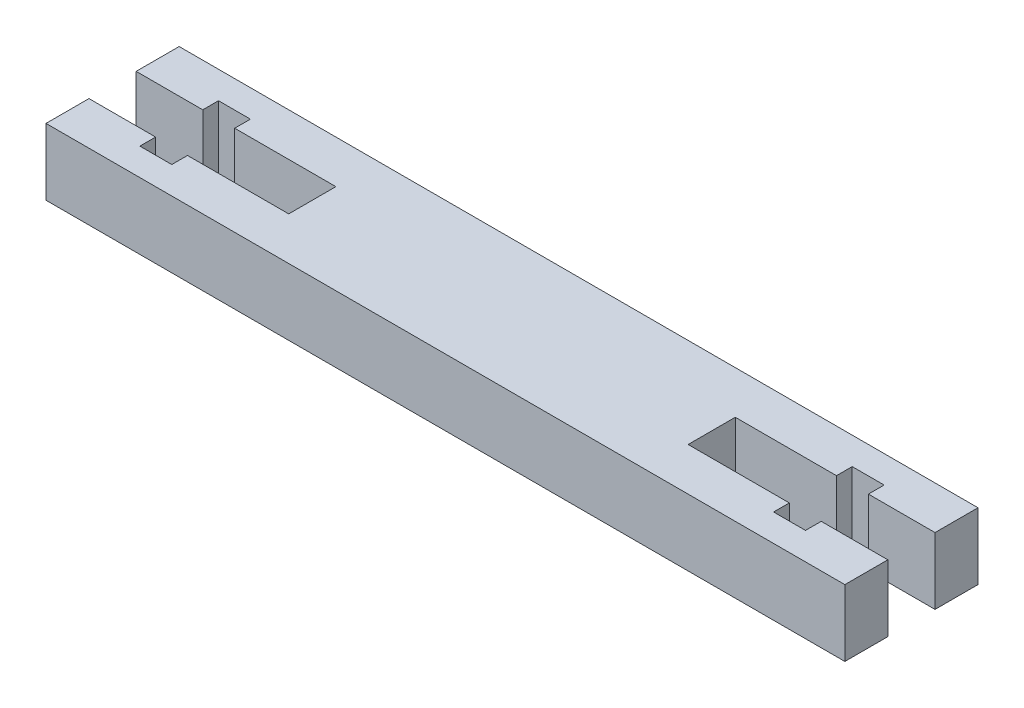
ISO-10303-21;
HEADER;
FILE_DESCRIPTION(('STEP AP214'),'2;1');
FILE_NAME('part.step','',(''),(''),'','','');
FILE_SCHEMA(('AUTOMOTIVE_DESIGN { 1 0 10303 214 1 1 1 1 }'));
ENDSEC;
DATA;
#1=APPLICATION_CONTEXT('core data for automotive mechanical design processes');
#2=APPLICATION_PROTOCOL_DEFINITION('international standard','automotive_design',2000,#1);
#3=PRODUCT_CONTEXT('',#1,'mechanical');
#4=PRODUCT('Part','Part','',(#3));
#5=PRODUCT_RELATED_PRODUCT_CATEGORY('part','',(#4));
#6=PRODUCT_DEFINITION_FORMATION('','',#4);
#7=PRODUCT_DEFINITION_CONTEXT('part definition',#1,'design');
#8=PRODUCT_DEFINITION('design','',#6,#7);
#9=PRODUCT_DEFINITION_SHAPE('','',#8);
#10=(LENGTH_UNIT() NAMED_UNIT(*) SI_UNIT(.MILLI.,.METRE.));
#11=(NAMED_UNIT(*) PLANE_ANGLE_UNIT() SI_UNIT($,.RADIAN.));
#12=(NAMED_UNIT(*) SI_UNIT($,.STERADIAN.) SOLID_ANGLE_UNIT());
#13=UNCERTAINTY_MEASURE_WITH_UNIT(LENGTH_MEASURE(1.E-05),#10,'distance_accuracy_value','');
#14=(GEOMETRIC_REPRESENTATION_CONTEXT(3) GLOBAL_UNCERTAINTY_ASSIGNED_CONTEXT((#13)) GLOBAL_UNIT_ASSIGNED_CONTEXT((#10,
#11,#12)) REPRESENTATION_CONTEXT('',''));
#15=CARTESIAN_POINT('',(0.,0.,0.));
#16=DIRECTION('',(0.,0.,1.));
#17=DIRECTION('',(1.,0.,0.));
#18=AXIS2_PLACEMENT_3D('',#15,#16,#17);
#19=CARTESIAN_POINT('',(0.,6.35,0.));
#20=DIRECTION('',(1.,0.,0.));
#21=DIRECTION('',(0.,0.,-1.));
#22=AXIS2_PLACEMENT_3D('',#19,#20,#21);
#23=PLANE('',#22);
#24=DIRECTION('',(0.,0.,1.));
#25=VECTOR('',#24,1.);
#26=CARTESIAN_POINT('',(0.,0.,0.));
#27=LINE('',#26,#25);
#28=CARTESIAN_POINT('',(0.,0.,0.));
#29=VERTEX_POINT('',#28);
#30=CARTESIAN_POINT('',(0.,0.,4.09999999999997));
#31=VERTEX_POINT('',#30);
#32=EDGE_CURVE('E371',#29,#31,#27,.T.);
#33=ORIENTED_EDGE('',*,*,#32,.T.);
#34=DIRECTION('',(0.,-1.,0.));
#35=VECTOR('',#34,1.);
#36=CARTESIAN_POINT('',(0.,6.35,4.09999999999997));
#37=LINE('',#36,#35);
#38=CARTESIAN_POINT('',(0.,6.35,4.09999999999997));
#39=VERTEX_POINT('',#38);
#40=EDGE_CURVE('E240',#39,#31,#37,.T.);
#41=ORIENTED_EDGE('',*,*,#40,.F.);
#42=DIRECTION('',(0.,0.,1.));
#43=VECTOR('',#42,1.);
#44=CARTESIAN_POINT('',(0.,6.35,0.));
#45=LINE('',#44,#43);
#46=CARTESIAN_POINT('',(0.,6.35,0.));
#47=VERTEX_POINT('',#46);
#48=EDGE_CURVE('E360',#47,#39,#45,.T.);
#49=ORIENTED_EDGE('',*,*,#48,.F.);
#50=DIRECTION('',(0.,-1.,0.));
#51=VECTOR('',#50,1.);
#52=CARTESIAN_POINT('',(0.,6.35,0.));
#53=LINE('',#52,#51);
#54=EDGE_CURVE('E370',#47,#29,#53,.T.);
#55=ORIENTED_EDGE('',*,*,#54,.T.);
#56=EDGE_LOOP('',(#33,#41,#49,#55));
#57=FACE_BOUND('',#56,.T.);
#58=ADVANCED_FACE('F33',(#57),#23,.F.);
#59=CARTESIAN_POINT('',(76.2,6.35,0.));
#60=DIRECTION('',(-1.,0.,0.));
#61=DIRECTION('',(0.,0.,1.));
#62=AXIS2_PLACEMENT_3D('',#59,#60,#61);
#63=PLANE('',#62);
#64=DIRECTION('',(0.,0.,-1.));
#65=VECTOR('',#64,1.);
#66=CARTESIAN_POINT('',(76.2,0.,0.));
#67=LINE('',#66,#65);
#68=CARTESIAN_POINT('',(76.2,0.,12.7));
#69=VERTEX_POINT('',#68);
#70=CARTESIAN_POINT('',(76.2,0.,8.60000000000005));
#71=VERTEX_POINT('',#70);
#72=EDGE_CURVE('E377',#69,#71,#67,.T.);
#73=ORIENTED_EDGE('',*,*,#72,.T.);
#74=DIRECTION('',(0.,-1.,0.));
#75=VECTOR('',#74,1.);
#76=CARTESIAN_POINT('',(76.2,6.35,8.60000000000005));
#77=LINE('',#76,#75);
#78=CARTESIAN_POINT('',(76.2,6.35,8.60000000000005));
#79=VERTEX_POINT('',#78);
#80=EDGE_CURVE('E267',#79,#71,#77,.T.);
#81=ORIENTED_EDGE('',*,*,#80,.F.);
#82=DIRECTION('',(0.,0.,-1.));
#83=VECTOR('',#82,1.);
#84=CARTESIAN_POINT('',(76.2,6.35,0.));
#85=LINE('',#84,#83);
#86=CARTESIAN_POINT('',(76.2,6.35,12.7));
#87=VERTEX_POINT('',#86);
#88=EDGE_CURVE('E236',#87,#79,#85,.T.);
#89=ORIENTED_EDGE('',*,*,#88,.F.);
#90=DIRECTION('',(0.,-1.,0.));
#91=VECTOR('',#90,1.);
#92=CARTESIAN_POINT('',(76.2,6.35,12.7));
#93=LINE('',#92,#91);
#94=EDGE_CURVE('E387',#87,#69,#93,.T.);
#95=ORIENTED_EDGE('',*,*,#94,.T.);
#96=EDGE_LOOP('',(#73,#81,#89,#95));
#97=FACE_BOUND('',#96,.T.);
#98=ADVANCED_FACE('F491',(#97),#63,.F.);
#99=CARTESIAN_POINT('',(0.,6.35,8.59999999999997));
#100=VERTEX_POINT('',#99);
#101=CARTESIAN_POINT('',(0.,6.35,12.7));
#102=VERTEX_POINT('',#101);
#103=EDGE_CURVE('E364',#100,#102,#45,.T.);
#104=ORIENTED_EDGE('',*,*,#103,.F.);
#105=DIRECTION('',(0.,-1.,0.));
#106=VECTOR('',#105,1.);
#107=CARTESIAN_POINT('',(0.,6.35,8.59999999999997));
#108=LINE('',#107,#106);
#109=CARTESIAN_POINT('',(0.,0.,8.59999999999997));
#110=VERTEX_POINT('',#109);
#111=EDGE_CURVE('E332',#100,#110,#108,.T.);
#112=ORIENTED_EDGE('',*,*,#111,.T.);
#113=CARTESIAN_POINT('',(0.,0.,12.7));
#114=VERTEX_POINT('',#113);
#115=EDGE_CURVE('E269',#110,#114,#27,.T.);
#116=ORIENTED_EDGE('',*,*,#115,.T.);
#117=DIRECTION('',(0.,-1.,0.));
#118=VECTOR('',#117,1.);
#119=CARTESIAN_POINT('',(0.,6.35,12.7));
#120=LINE('',#119,#118);
#121=EDGE_CURVE('E390',#102,#114,#120,.T.);
#122=ORIENTED_EDGE('',*,*,#121,.F.);
#123=EDGE_LOOP('',(#104,#112,#116,#122));
#124=FACE_BOUND('',#123,.T.);
#125=ADVANCED_FACE('F35',(#124),#23,.F.);
#126=CARTESIAN_POINT('',(0.,6.35,12.7));
#127=DIRECTION('',(0.,0.,-1.));
#128=DIRECTION('',(-1.,0.,0.));
#129=AXIS2_PLACEMENT_3D('',#126,#127,#128);
#130=PLANE('',#129);
#131=DIRECTION('',(1.,0.,0.));
#132=VECTOR('',#131,1.);
#133=CARTESIAN_POINT('',(0.,0.,12.7));
#134=LINE('',#133,#132);
#135=EDGE_CURVE('E374',#114,#69,#134,.T.);
#136=ORIENTED_EDGE('',*,*,#135,.T.);
#137=ORIENTED_EDGE('',*,*,#94,.F.);
#138=DIRECTION('',(1.,0.,0.));
#139=VECTOR('',#138,1.);
#140=CARTESIAN_POINT('',(0.,6.35,12.7));
#141=LINE('',#140,#139);
#142=EDGE_CURVE('E363',#102,#87,#141,.T.);
#143=ORIENTED_EDGE('',*,*,#142,.F.);
#144=ORIENTED_EDGE('',*,*,#121,.T.);
#145=EDGE_LOOP('',(#136,#137,#143,#144));
#146=FACE_BOUND('',#145,.T.);
#147=ADVANCED_FACE('F495',(#146),#130,.F.);
#148=CARTESIAN_POINT('',(76.2,6.35,4.10000000000006));
#149=VERTEX_POINT('',#148);
#150=CARTESIAN_POINT('',(76.2,6.35,0.));
#151=VERTEX_POINT('',#150);
#152=EDGE_CURVE('E366',#149,#151,#85,.T.);
#153=ORIENTED_EDGE('',*,*,#152,.F.);
#154=DIRECTION('',(0.,-1.,0.));
#155=VECTOR('',#154,1.);
#156=CARTESIAN_POINT('',(76.2,6.35,4.10000000000006));
#157=LINE('',#156,#155);
#158=CARTESIAN_POINT('',(76.2,0.,4.10000000000006));
#159=VERTEX_POINT('',#158);
#160=EDGE_CURVE('E270',#149,#159,#157,.T.);
#161=ORIENTED_EDGE('',*,*,#160,.T.);
#162=CARTESIAN_POINT('',(76.2,0.,0.));
#163=VERTEX_POINT('',#162);
#164=EDGE_CURVE('E376',#159,#163,#67,.T.);
#165=ORIENTED_EDGE('',*,*,#164,.T.);
#166=DIRECTION('',(0.,-1.,0.));
#167=VECTOR('',#166,1.);
#168=CARTESIAN_POINT('',(76.2,6.35,0.));
#169=LINE('',#168,#167);
#170=EDGE_CURVE('E384',#151,#163,#169,.T.);
#171=ORIENTED_EDGE('',*,*,#170,.F.);
#172=EDGE_LOOP('',(#153,#161,#165,#171));
#173=FACE_BOUND('',#172,.T.);
#174=ADVANCED_FACE('F461',(#173),#63,.F.);
#175=CARTESIAN_POINT('',(0.,6.35,0.));
#176=DIRECTION('',(0.,0.,1.));
#177=DIRECTION('',(1.,0.,0.));
#178=AXIS2_PLACEMENT_3D('',#175,#176,#177);
#179=PLANE('',#178);
#180=DIRECTION('',(-1.,0.,0.));
#181=VECTOR('',#180,1.);
#182=CARTESIAN_POINT('',(0.,0.,0.));
#183=LINE('',#182,#181);
#184=EDGE_CURVE('E380',#163,#29,#183,.T.);
#185=ORIENTED_EDGE('',*,*,#184,.T.);
#186=ORIENTED_EDGE('',*,*,#54,.F.);
#187=DIRECTION('',(-1.,0.,0.));
#188=VECTOR('',#187,1.);
#189=CARTESIAN_POINT('',(0.,6.35,0.));
#190=LINE('',#189,#188);
#191=EDGE_CURVE('E368',#151,#47,#190,.T.);
#192=ORIENTED_EDGE('',*,*,#191,.F.);
#193=ORIENTED_EDGE('',*,*,#170,.T.);
#194=EDGE_LOOP('',(#185,#186,#192,#193));
#195=FACE_BOUND('',#194,.T.);
#196=ADVANCED_FACE('F535',(#195),#179,.F.);
#197=CARTESIAN_POINT('',(0.,6.35,0.));
#198=DIRECTION('',(0.,1.,0.));
#199=DIRECTION('',(0.,0.,1.));
#200=AXIS2_PLACEMENT_3D('',#197,#198,#199);
#201=PLANE('',#200);
#202=DIRECTION('',(-1.,0.,0.));
#203=VECTOR('',#202,1.);
#204=CARTESIAN_POINT('',(76.2,6.35,8.60000000000005));
#205=LINE('',#204,#203);
#206=CARTESIAN_POINT('',(69.8458727936633,6.35,8.60000000000004));
#207=VERTEX_POINT('',#206);
#208=EDGE_CURVE('E218',#79,#207,#205,.T.);
#209=ORIENTED_EDGE('',*,*,#208,.T.);
#210=DIRECTION('',(0.,0.,1.));
#211=VECTOR('',#210,1.);
#212=CARTESIAN_POINT('',(69.8458727936633,6.35,8.60000000000004));
#213=LINE('',#212,#211);
#214=CARTESIAN_POINT('',(69.8458727936632,6.35,10.1));
#215=VERTEX_POINT('',#214);
#216=EDGE_CURVE('E225',#207,#215,#213,.T.);
#217=ORIENTED_EDGE('',*,*,#216,.T.);
#218=DIRECTION('',(-1.,0.,0.));
#219=VECTOR('',#218,1.);
#220=CARTESIAN_POINT('',(69.8458727936632,6.35,10.1));
#221=LINE('',#220,#219);
#222=CARTESIAN_POINT('',(66.802,6.35,10.1));
#223=VERTEX_POINT('',#222);
#224=EDGE_CURVE('E231',#215,#223,#221,.T.);
#225=ORIENTED_EDGE('',*,*,#224,.T.);
#226=DIRECTION('',(0.,0.,-1.));
#227=VECTOR('',#226,1.);
#228=CARTESIAN_POINT('',(66.802,6.35,10.1));
#229=LINE('',#228,#227);
#230=CARTESIAN_POINT('',(66.802,6.35,8.60000000000004));
#231=VERTEX_POINT('',#230);
#232=EDGE_CURVE('E244',#223,#231,#229,.T.);
#233=ORIENTED_EDGE('',*,*,#232,.T.);
#234=DIRECTION('',(-1.,0.,0.));
#235=VECTOR('',#234,1.);
#236=CARTESIAN_POINT('',(66.802,6.35,8.60000000000004));
#237=LINE('',#236,#235);
#238=CARTESIAN_POINT('',(57.1495301352395,6.35,8.60000000000002));
#239=VERTEX_POINT('',#238);
#240=EDGE_CURVE('E247',#231,#239,#237,.T.);
#241=ORIENTED_EDGE('',*,*,#240,.T.);
#242=DIRECTION('',(0.,0.,-1.));
#243=VECTOR('',#242,1.);
#244=CARTESIAN_POINT('',(57.1495301352395,6.35,8.60000000000002));
#245=LINE('',#244,#243);
#246=CARTESIAN_POINT('',(57.1495301352395,6.35,4.10000000000001));
#247=VERTEX_POINT('',#246);
#248=EDGE_CURVE('E250',#239,#247,#245,.T.);
#249=ORIENTED_EDGE('',*,*,#248,.T.);
#250=DIRECTION('',(1.,0.,0.));
#251=VECTOR('',#250,1.);
#252=CARTESIAN_POINT('',(57.1495301352395,6.35,4.10000000000001));
#253=LINE('',#252,#251);
#254=CARTESIAN_POINT('',(66.802,6.35,4.10000000000004));
#255=VERTEX_POINT('',#254);
#256=EDGE_CURVE('E253',#247,#255,#253,.T.);
#257=ORIENTED_EDGE('',*,*,#256,.T.);
#258=DIRECTION('',(0.,0.,-1.));
#259=VECTOR('',#258,1.);
#260=CARTESIAN_POINT('',(66.802,6.35,2.60000000000004));
#261=LINE('',#260,#259);
#262=CARTESIAN_POINT('',(66.802,6.35,2.60000000000004));
#263=VERTEX_POINT('',#262);
#264=EDGE_CURVE('E256',#255,#263,#261,.T.);
#265=ORIENTED_EDGE('',*,*,#264,.T.);
#266=DIRECTION('',(1.,0.,0.));
#267=VECTOR('',#266,1.);
#268=CARTESIAN_POINT('',(69.8458727936633,6.35,2.60000000000004));
#269=LINE('',#268,#267);
#270=CARTESIAN_POINT('',(69.8458727936633,6.35,2.60000000000004));
#271=VERTEX_POINT('',#270);
#272=EDGE_CURVE('E259',#263,#271,#269,.T.);
#273=ORIENTED_EDGE('',*,*,#272,.T.);
#274=DIRECTION('',(0.,0.,1.));
#275=VECTOR('',#274,1.);
#276=CARTESIAN_POINT('',(69.8458727936633,6.35,4.10000000000004));
#277=LINE('',#276,#275);
#278=CARTESIAN_POINT('',(69.8458727936633,6.35,4.10000000000004));
#279=VERTEX_POINT('',#278);
#280=EDGE_CURVE('E262',#271,#279,#277,.T.);
#281=ORIENTED_EDGE('',*,*,#280,.T.);
#282=DIRECTION('',(1.,0.,0.));
#283=VECTOR('',#282,1.);
#284=CARTESIAN_POINT('',(76.2,6.35,4.10000000000006));
#285=LINE('',#284,#283);
#286=EDGE_CURVE('E222',#279,#149,#285,.T.);
#287=ORIENTED_EDGE('',*,*,#286,.T.);
#288=ORIENTED_EDGE('',*,*,#152,.T.);
#289=ORIENTED_EDGE('',*,*,#191,.T.);
#290=ORIENTED_EDGE('',*,*,#48,.T.);
#291=DIRECTION('',(1.,0.,0.));
#292=VECTOR('',#291,1.);
#293=CARTESIAN_POINT('',(0.,6.35,4.09999999999997));
#294=LINE('',#293,#292);
#295=CARTESIAN_POINT('',(6.35412720633672,6.35,4.09999999999997));
#296=VERTEX_POINT('',#295);
#297=EDGE_CURVE('E328',#39,#296,#294,.T.);
#298=ORIENTED_EDGE('',*,*,#297,.T.);
#299=DIRECTION('',(0.,0.,-1.));
#300=VECTOR('',#299,1.);
#301=CARTESIAN_POINT('',(6.35412720633672,6.35,4.09999999999997));
#302=LINE('',#301,#300);
#303=CARTESIAN_POINT('',(6.35412720633672,6.35,2.59999999999997));
#304=VERTEX_POINT('',#303);
#305=EDGE_CURVE('E298',#296,#304,#302,.T.);
#306=ORIENTED_EDGE('',*,*,#305,.T.);
#307=DIRECTION('',(1.,0.,0.));
#308=VECTOR('',#307,1.);
#309=CARTESIAN_POINT('',(6.35412720633672,6.35,2.59999999999997));
#310=LINE('',#309,#308);
#311=CARTESIAN_POINT('',(9.39799999999998,6.35,2.59999999999997));
#312=VERTEX_POINT('',#311);
#313=EDGE_CURVE('E301',#304,#312,#310,.T.);
#314=ORIENTED_EDGE('',*,*,#313,.T.);
#315=DIRECTION('',(0.,0.,1.));
#316=VECTOR('',#315,1.);
#317=CARTESIAN_POINT('',(9.39799999999998,6.35,2.59999999999997));
#318=LINE('',#317,#316);
#319=CARTESIAN_POINT('',(9.39799999999998,6.35,4.09999999999997));
#320=VERTEX_POINT('',#319);
#321=EDGE_CURVE('E304',#312,#320,#318,.T.);
#322=ORIENTED_EDGE('',*,*,#321,.T.);
#323=DIRECTION('',(1.,0.,0.));
#324=VECTOR('',#323,1.);
#325=CARTESIAN_POINT('',(19.0504698647605,6.35,4.09999999999997));
#326=LINE('',#325,#324);
#327=CARTESIAN_POINT('',(19.0504698647605,6.35,4.09999999999997));
#328=VERTEX_POINT('',#327);
#329=EDGE_CURVE('E307',#320,#328,#326,.T.);
#330=ORIENTED_EDGE('',*,*,#329,.T.);
#331=DIRECTION('',(0.,0.,1.));
#332=VECTOR('',#331,1.);
#333=CARTESIAN_POINT('',(19.0504698647605,6.35,8.59999999999997));
#334=LINE('',#333,#332);
#335=CARTESIAN_POINT('',(19.0504698647605,6.35,8.59999999999997));
#336=VERTEX_POINT('',#335);
#337=EDGE_CURVE('E310',#328,#336,#334,.T.);
#338=ORIENTED_EDGE('',*,*,#337,.T.);
#339=DIRECTION('',(-1.,0.,0.));
#340=VECTOR('',#339,1.);
#341=CARTESIAN_POINT('',(9.39799999999998,6.35,8.59999999999997));
#342=LINE('',#341,#340);
#343=CARTESIAN_POINT('',(9.39799999999998,6.35,8.59999999999997));
#344=VERTEX_POINT('',#343);
#345=EDGE_CURVE('E313',#336,#344,#342,.T.);
#346=ORIENTED_EDGE('',*,*,#345,.T.);
#347=DIRECTION('',(0.,0.,1.));
#348=VECTOR('',#347,1.);
#349=CARTESIAN_POINT('',(9.39799999999998,6.35,10.1));
#350=LINE('',#349,#348);
#351=CARTESIAN_POINT('',(9.39799999999998,6.35,10.1));
#352=VERTEX_POINT('',#351);
#353=EDGE_CURVE('E316',#344,#352,#350,.T.);
#354=ORIENTED_EDGE('',*,*,#353,.T.);
#355=DIRECTION('',(-1.,0.,0.));
#356=VECTOR('',#355,1.);
#357=CARTESIAN_POINT('',(6.35412720633672,6.35,10.1));
#358=LINE('',#357,#356);
#359=CARTESIAN_POINT('',(6.35412720633672,6.35,10.1));
#360=VERTEX_POINT('',#359);
#361=EDGE_CURVE('E319',#352,#360,#358,.T.);
#362=ORIENTED_EDGE('',*,*,#361,.T.);
#363=DIRECTION('',(0.,0.,-1.));
#364=VECTOR('',#363,1.);
#365=CARTESIAN_POINT('',(6.35412720633672,6.35,8.59999999999997));
#366=LINE('',#365,#364);
#367=CARTESIAN_POINT('',(6.35412720633672,6.35,8.59999999999997));
#368=VERTEX_POINT('',#367);
#369=EDGE_CURVE('E322',#360,#368,#366,.T.);
#370=ORIENTED_EDGE('',*,*,#369,.T.);
#371=DIRECTION('',(-1.,0.,0.));
#372=VECTOR('',#371,1.);
#373=CARTESIAN_POINT('',(0.,6.35,8.59999999999997));
#374=LINE('',#373,#372);
#375=EDGE_CURVE('E325',#368,#100,#374,.T.);
#376=ORIENTED_EDGE('',*,*,#375,.T.);
#377=ORIENTED_EDGE('',*,*,#103,.T.);
#378=ORIENTED_EDGE('',*,*,#142,.T.);
#379=ORIENTED_EDGE('',*,*,#88,.T.);
#380=EDGE_LOOP('',(#209,#217,#225,#233,#241,#249,#257,#265,#273,#281,#287,#288,#289,#290,#298,
#306,#314,#322,#330,#338,#346,#354,#362,#370,#376,#377,#378,#379));
#381=FACE_BOUND('',#380,.T.);
#382=ADVANCED_FACE('F234',(#381),#201,.T.);
#383=CARTESIAN_POINT('',(0.,0.,0.));
#384=DIRECTION('',(0.,1.,0.));
#385=DIRECTION('',(0.,0.,1.));
#386=AXIS2_PLACEMENT_3D('',#383,#384,#385);
#387=PLANE('',#386);
#388=DIRECTION('',(0.,0.,-1.));
#389=VECTOR('',#388,1.);
#390=CARTESIAN_POINT('',(69.8458727936634,0.,1.29240826917608E-12));
#391=LINE('',#390,#389);
#392=CARTESIAN_POINT('',(69.8458727936632,0.,10.1));
#393=VERTEX_POINT('',#392);
#394=CARTESIAN_POINT('',(69.8458727936633,0.,8.60000000000004));
#395=VERTEX_POINT('',#394);
#396=EDGE_CURVE('E426',#393,#395,#391,.T.);
#397=ORIENTED_EDGE('',*,*,#396,.T.);
#398=DIRECTION('',(1.,0.,0.));
#399=VECTOR('',#398,1.);
#400=CARTESIAN_POINT('',(0.,0.,8.59999999999989));
#401=LINE('',#400,#399);
#402=EDGE_CURVE('E11',#395,#71,#401,.T.);
#403=ORIENTED_EDGE('',*,*,#402,.T.);
#404=ORIENTED_EDGE('',*,*,#72,.F.);
#405=ORIENTED_EDGE('',*,*,#135,.F.);
#406=ORIENTED_EDGE('',*,*,#115,.F.);
#407=DIRECTION('',(1.,0.,0.));
#408=VECTOR('',#407,1.);
#409=CARTESIAN_POINT('',(0.,0.,8.59999999999997));
#410=LINE('',#409,#408);
#411=CARTESIAN_POINT('',(6.35412720633672,0.,8.59999999999997));
#412=VERTEX_POINT('',#411);
#413=EDGE_CURVE('E417',#110,#412,#410,.T.);
#414=ORIENTED_EDGE('',*,*,#413,.T.);
#415=DIRECTION('',(0.,0.,1.));
#416=VECTOR('',#415,1.);
#417=CARTESIAN_POINT('',(6.35412720633672,0.,0.));
#418=LINE('',#417,#416);
#419=CARTESIAN_POINT('',(6.35412720633672,0.,10.1));
#420=VERTEX_POINT('',#419);
#421=EDGE_CURVE('E414',#412,#420,#418,.T.);
#422=ORIENTED_EDGE('',*,*,#421,.T.);
#423=DIRECTION('',(1.,0.,0.));
#424=VECTOR('',#423,1.);
#425=CARTESIAN_POINT('',(0.,0.,10.1));
#426=LINE('',#425,#424);
#427=CARTESIAN_POINT('',(9.39799999999998,0.,10.1));
#428=VERTEX_POINT('',#427);
#429=EDGE_CURVE('E411',#420,#428,#426,.T.);
#430=ORIENTED_EDGE('',*,*,#429,.T.);
#431=DIRECTION('',(0.,0.,-1.));
#432=VECTOR('',#431,1.);
#433=CARTESIAN_POINT('',(9.39799999999998,0.,0.));
#434=LINE('',#433,#432);
#435=CARTESIAN_POINT('',(9.39799999999998,0.,8.59999999999997));
#436=VERTEX_POINT('',#435);
#437=EDGE_CURVE('E408',#428,#436,#434,.T.);
#438=ORIENTED_EDGE('',*,*,#437,.T.);
#439=DIRECTION('',(1.,0.,0.));
#440=VECTOR('',#439,1.);
#441=CARTESIAN_POINT('',(0.,0.,8.59999999999997));
#442=LINE('',#441,#440);
#443=CARTESIAN_POINT('',(19.0504698647605,0.,8.59999999999997));
#444=VERTEX_POINT('',#443);
#445=EDGE_CURVE('E405',#436,#444,#442,.T.);
#446=ORIENTED_EDGE('',*,*,#445,.T.);
#447=DIRECTION('',(0.,0.,-1.));
#448=VECTOR('',#447,1.);
#449=CARTESIAN_POINT('',(19.0504698647605,0.,0.));
#450=LINE('',#449,#448);
#451=CARTESIAN_POINT('',(19.0504698647605,0.,4.09999999999997));
#452=VERTEX_POINT('',#451);
#453=EDGE_CURVE('E402',#444,#452,#450,.T.);
#454=ORIENTED_EDGE('',*,*,#453,.T.);
#455=DIRECTION('',(-1.,0.,0.));
#456=VECTOR('',#455,1.);
#457=CARTESIAN_POINT('',(0.,0.,4.09999999999997));
#458=LINE('',#457,#456);
#459=CARTESIAN_POINT('',(9.39799999999998,0.,4.09999999999997));
#460=VERTEX_POINT('',#459);
#461=EDGE_CURVE('E399',#452,#460,#458,.T.);
#462=ORIENTED_EDGE('',*,*,#461,.T.);
#463=DIRECTION('',(0.,0.,-1.));
#464=VECTOR('',#463,1.);
#465=CARTESIAN_POINT('',(9.39799999999998,0.,0.));
#466=LINE('',#465,#464);
#467=CARTESIAN_POINT('',(9.39799999999998,0.,2.59999999999997));
#468=VERTEX_POINT('',#467);
#469=EDGE_CURVE('E396',#460,#468,#466,.T.);
#470=ORIENTED_EDGE('',*,*,#469,.T.);
#471=DIRECTION('',(-1.,0.,0.));
#472=VECTOR('',#471,1.);
#473=CARTESIAN_POINT('',(0.,0.,2.59999999999997));
#474=LINE('',#473,#472);
#475=CARTESIAN_POINT('',(6.35412720633672,0.,2.59999999999997));
#476=VERTEX_POINT('',#475);
#477=EDGE_CURVE('E393',#468,#476,#474,.T.);
#478=ORIENTED_EDGE('',*,*,#477,.T.);
#479=DIRECTION('',(0.,0.,1.));
#480=VECTOR('',#479,1.);
#481=CARTESIAN_POINT('',(6.35412720633672,0.,0.));
#482=LINE('',#481,#480);
#483=CARTESIAN_POINT('',(6.35412720633672,0.,4.09999999999997));
#484=VERTEX_POINT('',#483);
#485=EDGE_CURVE('E420',#476,#484,#482,.T.);
#486=ORIENTED_EDGE('',*,*,#485,.T.);
#487=DIRECTION('',(-1.,0.,0.));
#488=VECTOR('',#487,1.);
#489=CARTESIAN_POINT('',(0.,0.,4.09999999999997));
#490=LINE('',#489,#488);
#491=EDGE_CURVE('E423',#484,#31,#490,.T.);
#492=ORIENTED_EDGE('',*,*,#491,.T.);
#493=ORIENTED_EDGE('',*,*,#32,.F.);
#494=ORIENTED_EDGE('',*,*,#184,.F.);
#495=ORIENTED_EDGE('',*,*,#164,.F.);
#496=DIRECTION('',(-1.,0.,0.));
#497=VECTOR('',#496,1.);
#498=CARTESIAN_POINT('',(0.,0.,4.0999999999999));
#499=LINE('',#498,#497);
#500=CARTESIAN_POINT('',(69.8458727936633,0.,4.10000000000004));
#501=VERTEX_POINT('',#500);
#502=EDGE_CURVE('E41',#159,#501,#499,.T.);
#503=ORIENTED_EDGE('',*,*,#502,.T.);
#504=DIRECTION('',(0.,0.,-1.));
#505=VECTOR('',#504,1.);
#506=CARTESIAN_POINT('',(69.8458727936633,0.,0.));
#507=LINE('',#506,#505);
#508=CARTESIAN_POINT('',(69.8458727936633,0.,2.60000000000004));
#509=VERTEX_POINT('',#508);
#510=EDGE_CURVE('E449',#501,#509,#507,.T.);
#511=ORIENTED_EDGE('',*,*,#510,.T.);
#512=DIRECTION('',(-1.,0.,0.));
#513=VECTOR('',#512,1.);
#514=CARTESIAN_POINT('',(0.,0.,2.59999999999988));
#515=LINE('',#514,#513);
#516=CARTESIAN_POINT('',(66.802,0.,2.60000000000004));
#517=VERTEX_POINT('',#516);
#518=EDGE_CURVE('E446',#509,#517,#515,.T.);
#519=ORIENTED_EDGE('',*,*,#518,.T.);
#520=DIRECTION('',(0.,0.,1.));
#521=VECTOR('',#520,1.);
#522=CARTESIAN_POINT('',(66.802,0.,0.));
#523=LINE('',#522,#521);
#524=CARTESIAN_POINT('',(66.802,0.,4.10000000000004));
#525=VERTEX_POINT('',#524);
#526=EDGE_CURVE('E443',#517,#525,#523,.T.);
#527=ORIENTED_EDGE('',*,*,#526,.T.);
#528=DIRECTION('',(-1.,0.,0.));
#529=VECTOR('',#528,1.);
#530=CARTESIAN_POINT('',(0.,0.,4.09999999999989));
#531=LINE('',#530,#529);
#532=CARTESIAN_POINT('',(57.1495301352395,0.,4.10000000000001));
#533=VERTEX_POINT('',#532);
#534=EDGE_CURVE('E440',#525,#533,#531,.T.);
#535=ORIENTED_EDGE('',*,*,#534,.T.);
#536=DIRECTION('',(0.,0.,1.));
#537=VECTOR('',#536,1.);
#538=CARTESIAN_POINT('',(57.1495301352396,0.,1.76246456118478E-13));
#539=LINE('',#538,#537);
#540=CARTESIAN_POINT('',(57.1495301352395,0.,8.60000000000002));
#541=VERTEX_POINT('',#540);
#542=EDGE_CURVE('E437',#533,#541,#539,.T.);
#543=ORIENTED_EDGE('',*,*,#542,.T.);
#544=DIRECTION('',(1.,0.,0.));
#545=VECTOR('',#544,1.);
#546=CARTESIAN_POINT('',(0.,0.,8.5999999999999));
#547=LINE('',#546,#545);
#548=CARTESIAN_POINT('',(66.802,0.,8.60000000000004));
#549=VERTEX_POINT('',#548);
#550=EDGE_CURVE('E434',#541,#549,#547,.T.);
#551=ORIENTED_EDGE('',*,*,#550,.T.);
#552=DIRECTION('',(0.,0.,1.));
#553=VECTOR('',#552,1.);
#554=CARTESIAN_POINT('',(66.802,0.,0.));
#555=LINE('',#554,#553);
#556=CARTESIAN_POINT('',(66.802,0.,10.1));
#557=VERTEX_POINT('',#556);
#558=EDGE_CURVE('E431',#549,#557,#555,.T.);
#559=ORIENTED_EDGE('',*,*,#558,.T.);
#560=DIRECTION('',(1.,0.,0.));
#561=VECTOR('',#560,1.);
#562=CARTESIAN_POINT('',(0.,0.,10.0999999999999));
#563=LINE('',#562,#561);
#564=EDGE_CURVE('E428',#557,#393,#563,.T.);
#565=ORIENTED_EDGE('',*,*,#564,.T.);
#566=EDGE_LOOP('',(#397,#403,#404,#405,#406,#414,#422,#430,#438,#446,#454,#462,#470,#478,#486,
#492,#493,#494,#495,#503,#511,#519,#527,#535,#543,#551,#559,#565));
#567=FACE_BOUND('',#566,.T.);
#568=ADVANCED_FACE('F454',(#567),#387,.F.);
#569=CARTESIAN_POINT('',(6.35412720633672,6.35,4.09999999999997));
#570=DIRECTION('',(-1.,0.,0.));
#571=DIRECTION('',(0.,0.,1.));
#572=AXIS2_PLACEMENT_3D('',#569,#570,#571);
#573=PLANE('',#572);
#574=DIRECTION('',(0.,-1.,0.));
#575=VECTOR('',#574,1.);
#576=CARTESIAN_POINT('',(6.35412720633672,6.35,2.59999999999997));
#577=LINE('',#576,#575);
#578=EDGE_CURVE('E56',#304,#476,#577,.T.);
#579=ORIENTED_EDGE('',*,*,#578,.F.);
#580=ORIENTED_EDGE('',*,*,#305,.F.);
#581=DIRECTION('',(0.,-1.,0.));
#582=VECTOR('',#581,1.);
#583=CARTESIAN_POINT('',(6.35412720633672,6.35,4.09999999999997));
#584=LINE('',#583,#582);
#585=EDGE_CURVE('E237',#296,#484,#584,.T.);
#586=ORIENTED_EDGE('',*,*,#585,.T.);
#587=ORIENTED_EDGE('',*,*,#485,.F.);
#588=EDGE_LOOP('',(#579,#580,#586,#587));
#589=FACE_BOUND('',#588,.T.);
#590=ADVANCED_FACE('F527',(#589),#573,.F.);
#591=CARTESIAN_POINT('',(0.,6.35,4.09999999999997));
#592=DIRECTION('',(0.,0.,-1.));
#593=DIRECTION('',(-1.,0.,0.));
#594=AXIS2_PLACEMENT_3D('',#591,#592,#593);
#595=PLANE('',#594);
#596=ORIENTED_EDGE('',*,*,#585,.F.);
#597=ORIENTED_EDGE('',*,*,#297,.F.);
#598=ORIENTED_EDGE('',*,*,#40,.T.);
#599=ORIENTED_EDGE('',*,*,#491,.F.);
#600=EDGE_LOOP('',(#596,#597,#598,#599));
#601=FACE_BOUND('',#600,.T.);
#602=ADVANCED_FACE('F529',(#601),#595,.F.);
#603=CARTESIAN_POINT('',(0.,6.35,8.59999999999997));
#604=DIRECTION('',(0.,0.,1.));
#605=DIRECTION('',(1.,0.,0.));
#606=AXIS2_PLACEMENT_3D('',#603,#604,#605);
#607=PLANE('',#606);
#608=ORIENTED_EDGE('',*,*,#111,.F.);
#609=ORIENTED_EDGE('',*,*,#375,.F.);
#610=DIRECTION('',(0.,-1.,0.));
#611=VECTOR('',#610,1.);
#612=CARTESIAN_POINT('',(6.35412720633672,6.35,8.59999999999997));
#613=LINE('',#612,#611);
#614=EDGE_CURVE('E335',#368,#412,#613,.T.);
#615=ORIENTED_EDGE('',*,*,#614,.T.);
#616=ORIENTED_EDGE('',*,*,#413,.F.);
#617=EDGE_LOOP('',(#608,#609,#615,#616));
#618=FACE_BOUND('',#617,.T.);
#619=ADVANCED_FACE('F502',(#618),#607,.F.);
#620=CARTESIAN_POINT('',(6.35412720633672,6.35,8.59999999999997));
#621=DIRECTION('',(-1.,0.,0.));
#622=DIRECTION('',(0.,0.,1.));
#623=AXIS2_PLACEMENT_3D('',#620,#621,#622);
#624=PLANE('',#623);
#625=ORIENTED_EDGE('',*,*,#614,.F.);
#626=ORIENTED_EDGE('',*,*,#369,.F.);
#627=DIRECTION('',(0.,-1.,0.));
#628=VECTOR('',#627,1.);
#629=CARTESIAN_POINT('',(6.35412720633672,6.35,10.1));
#630=LINE('',#629,#628);
#631=EDGE_CURVE('E338',#360,#420,#630,.T.);
#632=ORIENTED_EDGE('',*,*,#631,.T.);
#633=ORIENTED_EDGE('',*,*,#421,.F.);
#634=EDGE_LOOP('',(#625,#626,#632,#633));
#635=FACE_BOUND('',#634,.T.);
#636=ADVANCED_FACE('F506',(#635),#624,.F.);
#637=CARTESIAN_POINT('',(6.35412720633672,6.35,10.1));
#638=DIRECTION('',(0.,0.,1.));
#639=DIRECTION('',(1.,0.,0.));
#640=AXIS2_PLACEMENT_3D('',#637,#638,#639);
#641=PLANE('',#640);
#642=ORIENTED_EDGE('',*,*,#631,.F.);
#643=ORIENTED_EDGE('',*,*,#361,.F.);
#644=DIRECTION('',(0.,-1.,0.));
#645=VECTOR('',#644,1.);
#646=CARTESIAN_POINT('',(9.39799999999998,6.35,10.1));
#647=LINE('',#646,#645);
#648=EDGE_CURVE('E341',#352,#428,#647,.T.);
#649=ORIENTED_EDGE('',*,*,#648,.T.);
#650=ORIENTED_EDGE('',*,*,#429,.F.);
#651=EDGE_LOOP('',(#642,#643,#649,#650));
#652=FACE_BOUND('',#651,.T.);
#653=ADVANCED_FACE('F508',(#652),#641,.F.);
#654=CARTESIAN_POINT('',(9.39799999999998,6.35,10.1));
#655=DIRECTION('',(1.,0.,0.));
#656=DIRECTION('',(0.,0.,-1.));
#657=AXIS2_PLACEMENT_3D('',#654,#655,#656);
#658=PLANE('',#657);
#659=ORIENTED_EDGE('',*,*,#648,.F.);
#660=ORIENTED_EDGE('',*,*,#353,.F.);
#661=DIRECTION('',(0.,-1.,0.));
#662=VECTOR('',#661,1.);
#663=CARTESIAN_POINT('',(9.39799999999998,6.35,8.59999999999997));
#664=LINE('',#663,#662);
#665=EDGE_CURVE('E344',#344,#436,#664,.T.);
#666=ORIENTED_EDGE('',*,*,#665,.T.);
#667=ORIENTED_EDGE('',*,*,#437,.F.);
#668=EDGE_LOOP('',(#659,#660,#666,#667));
#669=FACE_BOUND('',#668,.T.);
#670=ADVANCED_FACE('F511',(#669),#658,.F.);
#671=CARTESIAN_POINT('',(9.39799999999998,6.35,8.59999999999997));
#672=DIRECTION('',(0.,0.,1.));
#673=DIRECTION('',(1.,0.,0.));
#674=AXIS2_PLACEMENT_3D('',#671,#672,#673);
#675=PLANE('',#674);
#676=ORIENTED_EDGE('',*,*,#665,.F.);
#677=ORIENTED_EDGE('',*,*,#345,.F.);
#678=DIRECTION('',(0.,-1.,0.));
#679=VECTOR('',#678,1.);
#680=CARTESIAN_POINT('',(19.0504698647605,6.35,8.59999999999997));
#681=LINE('',#680,#679);
#682=EDGE_CURVE('E347',#336,#444,#681,.T.);
#683=ORIENTED_EDGE('',*,*,#682,.T.);
#684=ORIENTED_EDGE('',*,*,#445,.F.);
#685=EDGE_LOOP('',(#676,#677,#683,#684));
#686=FACE_BOUND('',#685,.T.);
#687=ADVANCED_FACE('F514',(#686),#675,.F.);
#688=CARTESIAN_POINT('',(19.0504698647605,6.35,8.59999999999997));
#689=DIRECTION('',(1.,0.,0.));
#690=DIRECTION('',(0.,0.,-1.));
#691=AXIS2_PLACEMENT_3D('',#688,#689,#690);
#692=PLANE('',#691);
#693=ORIENTED_EDGE('',*,*,#682,.F.);
#694=ORIENTED_EDGE('',*,*,#337,.F.);
#695=DIRECTION('',(0.,-1.,0.));
#696=VECTOR('',#695,1.);
#697=CARTESIAN_POINT('',(19.0504698647605,6.35,4.09999999999997));
#698=LINE('',#697,#696);
#699=EDGE_CURVE('E350',#328,#452,#698,.T.);
#700=ORIENTED_EDGE('',*,*,#699,.T.);
#701=ORIENTED_EDGE('',*,*,#453,.F.);
#702=EDGE_LOOP('',(#693,#694,#700,#701));
#703=FACE_BOUND('',#702,.T.);
#704=ADVANCED_FACE('F516',(#703),#692,.F.);
#705=CARTESIAN_POINT('',(19.0504698647605,6.35,4.09999999999997));
#706=DIRECTION('',(0.,0.,-1.));
#707=DIRECTION('',(-1.,0.,0.));
#708=AXIS2_PLACEMENT_3D('',#705,#706,#707);
#709=PLANE('',#708);
#710=ORIENTED_EDGE('',*,*,#699,.F.);
#711=ORIENTED_EDGE('',*,*,#329,.F.);
#712=DIRECTION('',(0.,-1.,0.));
#713=VECTOR('',#712,1.);
#714=CARTESIAN_POINT('',(9.39799999999998,6.35,4.09999999999997));
#715=LINE('',#714,#713);
#716=EDGE_CURVE('E353',#320,#460,#715,.T.);
#717=ORIENTED_EDGE('',*,*,#716,.T.);
#718=ORIENTED_EDGE('',*,*,#461,.F.);
#719=EDGE_LOOP('',(#710,#711,#717,#718));
#720=FACE_BOUND('',#719,.T.);
#721=ADVANCED_FACE('F520',(#720),#709,.F.);
#722=CARTESIAN_POINT('',(9.39799999999998,6.35,2.59999999999997));
#723=DIRECTION('',(1.,0.,0.));
#724=DIRECTION('',(0.,0.,-1.));
#725=AXIS2_PLACEMENT_3D('',#722,#723,#724);
#726=PLANE('',#725);
#727=ORIENTED_EDGE('',*,*,#716,.F.);
#728=ORIENTED_EDGE('',*,*,#321,.F.);
#729=DIRECTION('',(0.,-1.,0.));
#730=VECTOR('',#729,1.);
#731=CARTESIAN_POINT('',(9.39799999999998,6.35,2.59999999999997));
#732=LINE('',#731,#730);
#733=EDGE_CURVE('E356',#312,#468,#732,.T.);
#734=ORIENTED_EDGE('',*,*,#733,.T.);
#735=ORIENTED_EDGE('',*,*,#469,.F.);
#736=EDGE_LOOP('',(#727,#728,#734,#735));
#737=FACE_BOUND('',#736,.T.);
#738=ADVANCED_FACE('F523',(#737),#726,.F.);
#739=CARTESIAN_POINT('',(6.35412720633672,6.35,2.59999999999997));
#740=DIRECTION('',(0.,0.,-1.));
#741=DIRECTION('',(-1.,0.,0.));
#742=AXIS2_PLACEMENT_3D('',#739,#740,#741);
#743=PLANE('',#742);
#744=ORIENTED_EDGE('',*,*,#733,.F.);
#745=ORIENTED_EDGE('',*,*,#313,.F.);
#746=ORIENTED_EDGE('',*,*,#578,.T.);
#747=ORIENTED_EDGE('',*,*,#477,.F.);
#748=EDGE_LOOP('',(#744,#745,#746,#747));
#749=FACE_BOUND('',#748,.T.);
#750=ADVANCED_FACE('F524',(#749),#743,.F.);
#751=CARTESIAN_POINT('',(76.2,6.35,8.60000000000005));
#752=DIRECTION('',(0.,0.,1.));
#753=DIRECTION('',(1.,0.,0.));
#754=AXIS2_PLACEMENT_3D('',#751,#752,#753);
#755=PLANE('',#754);
#756=DIRECTION('',(0.,-1.,0.));
#757=VECTOR('',#756,1.);
#758=CARTESIAN_POINT('',(69.8458727936633,6.35,8.60000000000004));
#759=LINE('',#758,#757);
#760=EDGE_CURVE('E48',#207,#395,#759,.T.);
#761=ORIENTED_EDGE('',*,*,#760,.F.);
#762=ORIENTED_EDGE('',*,*,#208,.F.);
#763=ORIENTED_EDGE('',*,*,#80,.T.);
#764=ORIENTED_EDGE('',*,*,#402,.F.);
#765=EDGE_LOOP('',(#761,#762,#763,#764));
#766=FACE_BOUND('',#765,.T.);
#767=ADVANCED_FACE('F216',(#766),#755,.F.);
#768=CARTESIAN_POINT('',(76.2,6.35,4.10000000000006));
#769=DIRECTION('',(0.,0.,-1.));
#770=DIRECTION('',(-1.,0.,0.));
#771=AXIS2_PLACEMENT_3D('',#768,#769,#770);
#772=PLANE('',#771);
#773=ORIENTED_EDGE('',*,*,#160,.F.);
#774=ORIENTED_EDGE('',*,*,#286,.F.);
#775=DIRECTION('',(0.,-1.,0.));
#776=VECTOR('',#775,1.);
#777=CARTESIAN_POINT('',(69.8458727936633,6.35,4.10000000000004));
#778=LINE('',#777,#776);
#779=EDGE_CURVE('E273',#279,#501,#778,.T.);
#780=ORIENTED_EDGE('',*,*,#779,.T.);
#781=ORIENTED_EDGE('',*,*,#502,.F.);
#782=EDGE_LOOP('',(#773,#774,#780,#781));
#783=FACE_BOUND('',#782,.T.);
#784=ADVANCED_FACE('F457',(#783),#772,.F.);
#785=CARTESIAN_POINT('',(69.8458727936633,6.35,4.10000000000004));
#786=DIRECTION('',(1.,0.,0.));
#787=DIRECTION('',(0.,0.,-1.));
#788=AXIS2_PLACEMENT_3D('',#785,#786,#787);
#789=PLANE('',#788);
#790=ORIENTED_EDGE('',*,*,#779,.F.);
#791=ORIENTED_EDGE('',*,*,#280,.F.);
#792=DIRECTION('',(0.,-1.,0.));
#793=VECTOR('',#792,1.);
#794=CARTESIAN_POINT('',(69.8458727936633,6.35,2.60000000000004));
#795=LINE('',#794,#793);
#796=EDGE_CURVE('E276',#271,#509,#795,.T.);
#797=ORIENTED_EDGE('',*,*,#796,.T.);
#798=ORIENTED_EDGE('',*,*,#510,.F.);
#799=EDGE_LOOP('',(#790,#791,#797,#798));
#800=FACE_BOUND('',#799,.T.);
#801=ADVANCED_FACE('F468',(#800),#789,.F.);
#802=CARTESIAN_POINT('',(69.8458727936633,6.35,2.60000000000004));
#803=DIRECTION('',(0.,0.,-1.));
#804=DIRECTION('',(-1.,0.,0.));
#805=AXIS2_PLACEMENT_3D('',#802,#803,#804);
#806=PLANE('',#805);
#807=ORIENTED_EDGE('',*,*,#796,.F.);
#808=ORIENTED_EDGE('',*,*,#272,.F.);
#809=DIRECTION('',(0.,-1.,0.));
#810=VECTOR('',#809,1.);
#811=CARTESIAN_POINT('',(66.802,6.35,2.60000000000004));
#812=LINE('',#811,#810);
#813=EDGE_CURVE('E279',#263,#517,#812,.T.);
#814=ORIENTED_EDGE('',*,*,#813,.T.);
#815=ORIENTED_EDGE('',*,*,#518,.F.);
#816=EDGE_LOOP('',(#807,#808,#814,#815));
#817=FACE_BOUND('',#816,.T.);
#818=ADVANCED_FACE('F470',(#817),#806,.F.);
#819=CARTESIAN_POINT('',(66.802,6.35,2.60000000000004));
#820=DIRECTION('',(-1.,0.,0.));
#821=DIRECTION('',(0.,0.,1.));
#822=AXIS2_PLACEMENT_3D('',#819,#820,#821);
#823=PLANE('',#822);
#824=ORIENTED_EDGE('',*,*,#813,.F.);
#825=ORIENTED_EDGE('',*,*,#264,.F.);
#826=DIRECTION('',(0.,-1.,0.));
#827=VECTOR('',#826,1.);
#828=CARTESIAN_POINT('',(66.802,6.35,4.10000000000004));
#829=LINE('',#828,#827);
#830=EDGE_CURVE('E282',#255,#525,#829,.T.);
#831=ORIENTED_EDGE('',*,*,#830,.T.);
#832=ORIENTED_EDGE('',*,*,#526,.F.);
#833=EDGE_LOOP('',(#824,#825,#831,#832));
#834=FACE_BOUND('',#833,.T.);
#835=ADVANCED_FACE('F472',(#834),#823,.F.);
#836=CARTESIAN_POINT('',(57.1495301352395,6.35,4.10000000000001));
#837=DIRECTION('',(0.,0.,-1.));
#838=DIRECTION('',(-1.,0.,0.));
#839=AXIS2_PLACEMENT_3D('',#836,#837,#838);
#840=PLANE('',#839);
#841=ORIENTED_EDGE('',*,*,#830,.F.);
#842=ORIENTED_EDGE('',*,*,#256,.F.);
#843=DIRECTION('',(0.,-1.,0.));
#844=VECTOR('',#843,1.);
#845=CARTESIAN_POINT('',(57.1495301352395,6.35,4.10000000000001));
#846=LINE('',#845,#844);
#847=EDGE_CURVE('E285',#247,#533,#846,.T.);
#848=ORIENTED_EDGE('',*,*,#847,.T.);
#849=ORIENTED_EDGE('',*,*,#534,.F.);
#850=EDGE_LOOP('',(#841,#842,#848,#849));
#851=FACE_BOUND('',#850,.T.);
#852=ADVANCED_FACE('F476',(#851),#840,.F.);
#853=CARTESIAN_POINT('',(57.1495301352395,6.35,8.60000000000002));
#854=DIRECTION('',(-1.,0.,0.));
#855=DIRECTION('',(0.,0.,1.));
#856=AXIS2_PLACEMENT_3D('',#853,#854,#855);
#857=PLANE('',#856);
#858=ORIENTED_EDGE('',*,*,#847,.F.);
#859=ORIENTED_EDGE('',*,*,#248,.F.);
#860=DIRECTION('',(0.,-1.,0.));
#861=VECTOR('',#860,1.);
#862=CARTESIAN_POINT('',(57.1495301352395,6.35,8.60000000000002));
#863=LINE('',#862,#861);
#864=EDGE_CURVE('E288',#239,#541,#863,.T.);
#865=ORIENTED_EDGE('',*,*,#864,.T.);
#866=ORIENTED_EDGE('',*,*,#542,.F.);
#867=EDGE_LOOP('',(#858,#859,#865,#866));
#868=FACE_BOUND('',#867,.T.);
#869=ADVANCED_FACE('F479',(#868),#857,.F.);
#870=CARTESIAN_POINT('',(66.802,6.35,8.60000000000004));
#871=DIRECTION('',(0.,0.,1.));
#872=DIRECTION('',(1.,0.,0.));
#873=AXIS2_PLACEMENT_3D('',#870,#871,#872);
#874=PLANE('',#873);
#875=ORIENTED_EDGE('',*,*,#864,.F.);
#876=ORIENTED_EDGE('',*,*,#240,.F.);
#877=DIRECTION('',(0.,-1.,0.));
#878=VECTOR('',#877,1.);
#879=CARTESIAN_POINT('',(66.802,6.35,8.60000000000004));
#880=LINE('',#879,#878);
#881=EDGE_CURVE('E291',#231,#549,#880,.T.);
#882=ORIENTED_EDGE('',*,*,#881,.T.);
#883=ORIENTED_EDGE('',*,*,#550,.F.);
#884=EDGE_LOOP('',(#875,#876,#882,#883));
#885=FACE_BOUND('',#884,.T.);
#886=ADVANCED_FACE('F481',(#885),#874,.F.);
#887=CARTESIAN_POINT('',(66.802,6.35,10.1));
#888=DIRECTION('',(-1.,0.,0.));
#889=DIRECTION('',(0.,0.,1.));
#890=AXIS2_PLACEMENT_3D('',#887,#888,#889);
#891=PLANE('',#890);
#892=ORIENTED_EDGE('',*,*,#881,.F.);
#893=ORIENTED_EDGE('',*,*,#232,.F.);
#894=DIRECTION('',(0.,-1.,0.));
#895=VECTOR('',#894,1.);
#896=CARTESIAN_POINT('',(66.802,6.35,10.1));
#897=LINE('',#896,#895);
#898=EDGE_CURVE('E294',#223,#557,#897,.T.);
#899=ORIENTED_EDGE('',*,*,#898,.T.);
#900=ORIENTED_EDGE('',*,*,#558,.F.);
#901=EDGE_LOOP('',(#892,#893,#899,#900));
#902=FACE_BOUND('',#901,.T.);
#903=ADVANCED_FACE('F485',(#902),#891,.F.);
#904=CARTESIAN_POINT('',(69.8458727936632,6.35,10.1));
#905=DIRECTION('',(0.,0.,1.));
#906=DIRECTION('',(1.,0.,0.));
#907=AXIS2_PLACEMENT_3D('',#904,#905,#906);
#908=PLANE('',#907);
#909=ORIENTED_EDGE('',*,*,#898,.F.);
#910=ORIENTED_EDGE('',*,*,#224,.F.);
#911=DIRECTION('',(0.,-1.,0.));
#912=VECTOR('',#911,1.);
#913=CARTESIAN_POINT('',(69.8458727936632,6.35,10.1));
#914=LINE('',#913,#912);
#915=EDGE_CURVE('E221',#215,#393,#914,.T.);
#916=ORIENTED_EDGE('',*,*,#915,.T.);
#917=ORIENTED_EDGE('',*,*,#564,.F.);
#918=EDGE_LOOP('',(#909,#910,#916,#917));
#919=FACE_BOUND('',#918,.T.);
#920=ADVANCED_FACE('F487',(#919),#908,.F.);
#921=CARTESIAN_POINT('',(69.8458727936633,6.35,8.60000000000004));
#922=DIRECTION('',(1.,0.,0.));
#923=DIRECTION('',(0.,0.,-1.));
#924=AXIS2_PLACEMENT_3D('',#921,#922,#923);
#925=PLANE('',#924);
#926=ORIENTED_EDGE('',*,*,#915,.F.);
#927=ORIENTED_EDGE('',*,*,#216,.F.);
#928=ORIENTED_EDGE('',*,*,#760,.T.);
#929=ORIENTED_EDGE('',*,*,#396,.F.);
#930=EDGE_LOOP('',(#926,#927,#928,#929));
#931=FACE_BOUND('',#930,.T.);
#932=ADVANCED_FACE('F226',(#931),#925,.F.);
#933=CLOSED_SHELL('',(#58,#98,#125,#147,#174,#196,#382,#568,#590,#602,#619,#636,#653,#670,#687,
#704,#721,#738,#750,#767,#784,#801,#818,#835,#852,#869,#886,#903,#920,#932));
#934=MANIFOLD_SOLID_BREP('B2',#933);
#935=ADVANCED_BREP_SHAPE_REPRESENTATION('',(#18,#934),#14);
#936=SHAPE_DEFINITION_REPRESENTATION(#9,#935);
ENDSEC;
END-ISO-10303-21;
